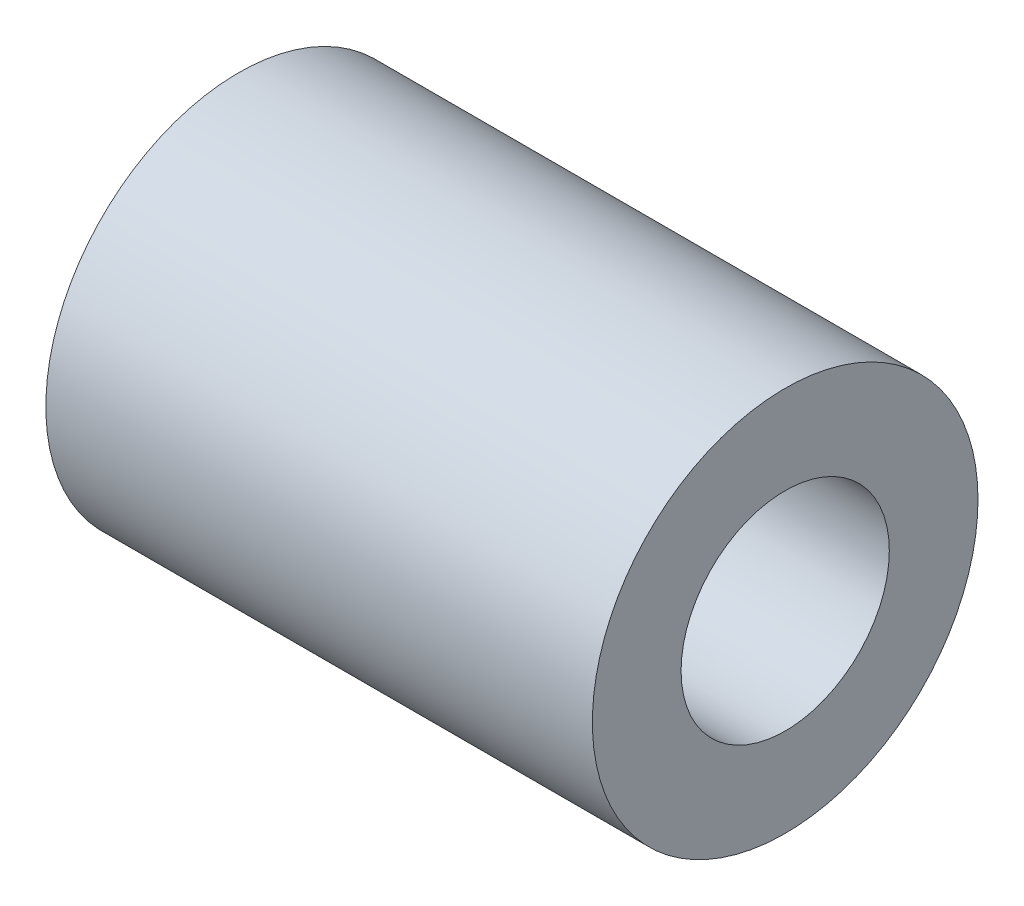
ISO-10303-21;
HEADER;
FILE_DESCRIPTION(('STEP AP214'),'2;1');
FILE_NAME('part.step','',(''),(''),'','','');
FILE_SCHEMA(('AUTOMOTIVE_DESIGN { 1 0 10303 214 1 1 1 1 }'));
ENDSEC;
DATA;
#1=APPLICATION_CONTEXT('core data for automotive mechanical design processes');
#2=APPLICATION_PROTOCOL_DEFINITION('international standard','automotive_design',2000,#1);
#3=PRODUCT_CONTEXT('',#1,'mechanical');
#4=PRODUCT('Part','Part','',(#3));
#5=PRODUCT_RELATED_PRODUCT_CATEGORY('part','',(#4));
#6=PRODUCT_DEFINITION_FORMATION('','',#4);
#7=PRODUCT_DEFINITION_CONTEXT('part definition',#1,'design');
#8=PRODUCT_DEFINITION('design','',#6,#7);
#9=PRODUCT_DEFINITION_SHAPE('','',#8);
#10=(LENGTH_UNIT() NAMED_UNIT(*) SI_UNIT(.MILLI.,.METRE.));
#11=(NAMED_UNIT(*) PLANE_ANGLE_UNIT() SI_UNIT($,.RADIAN.));
#12=(NAMED_UNIT(*) SI_UNIT($,.STERADIAN.) SOLID_ANGLE_UNIT());
#13=UNCERTAINTY_MEASURE_WITH_UNIT(LENGTH_MEASURE(1.E-05),#10,'distance_accuracy_value','');
#14=(GEOMETRIC_REPRESENTATION_CONTEXT(3) GLOBAL_UNCERTAINTY_ASSIGNED_CONTEXT((#13)) GLOBAL_UNIT_ASSIGNED_CONTEXT((#10,
#11,#12)) REPRESENTATION_CONTEXT('',''));
#15=CARTESIAN_POINT('',(0.,0.,0.));
#16=DIRECTION('',(0.,0.,1.));
#17=DIRECTION('',(1.,0.,0.));
#18=AXIS2_PLACEMENT_3D('',#15,#16,#17);
#19=CARTESIAN_POINT('',(-18.,0.,0.));
#20=DIRECTION('',(1.,0.,0.));
#21=DIRECTION('',(0.,0.,-1.));
#22=AXIS2_PLACEMENT_3D('',#19,#20,#21);
#23=CYLINDRICAL_SURFACE('',#22,6.35);
#24=CARTESIAN_POINT('',(-18.,0.,0.));
#25=DIRECTION('',(1.,0.,0.));
#26=DIRECTION('',(0.,0.,-1.));
#27=AXIS2_PLACEMENT_3D('',#24,#25,#26);
#28=CIRCLE('',#27,6.35);
#29=CARTESIAN_POINT('',(-18.,0.,-6.35));
#30=VERTEX_POINT('',#29);
#31=EDGE_CURVE('E10',#30,#30,#28,.T.);
#32=ORIENTED_EDGE('',*,*,#31,.T.);
#33=EDGE_LOOP('',(#32));
#34=FACE_BOUND('',#33,.T.);
#35=CARTESIAN_POINT('',(0.,0.,0.));
#36=DIRECTION('',(1.,0.,0.));
#37=DIRECTION('',(0.,0.,-1.));
#38=AXIS2_PLACEMENT_3D('',#35,#36,#37);
#39=CIRCLE('',#38,6.35);
#40=CARTESIAN_POINT('',(0.,0.,-6.35));
#41=VERTEX_POINT('',#40);
#42=EDGE_CURVE('E34',#41,#41,#39,.T.);
#43=ORIENTED_EDGE('',*,*,#42,.F.);
#44=EDGE_LOOP('',(#43));
#45=FACE_BOUND('',#44,.T.);
#46=ADVANCED_FACE('F31',(#34,#45),#23,.T.);
#47=CARTESIAN_POINT('',(-18.,0.,0.));
#48=DIRECTION('',(1.,0.,0.));
#49=DIRECTION('',(0.,0.,-1.));
#50=AXIS2_PLACEMENT_3D('',#47,#48,#49);
#51=PLANE('',#50);
#52=CARTESIAN_POINT('',(-18.,0.,0.));
#53=DIRECTION('',(1.,0.,0.));
#54=DIRECTION('',(0.,0.,-1.));
#55=AXIS2_PLACEMENT_3D('',#52,#53,#54);
#56=CIRCLE('',#55,3.429);
#57=CARTESIAN_POINT('',(-18.,0.,-3.429));
#58=VERTEX_POINT('',#57);
#59=EDGE_CURVE('E41',#58,#58,#56,.T.);
#60=ORIENTED_EDGE('',*,*,#59,.T.);
#61=EDGE_LOOP('',(#60));
#62=FACE_BOUND('',#61,.T.);
#63=ORIENTED_EDGE('',*,*,#31,.F.);
#64=EDGE_LOOP('',(#63));
#65=FACE_BOUND('',#64,.T.);
#66=ADVANCED_FACE('F49',(#62,#65),#51,.F.);
#67=CARTESIAN_POINT('',(0.,0.,0.));
#68=DIRECTION('',(1.,0.,0.));
#69=DIRECTION('',(0.,0.,-1.));
#70=AXIS2_PLACEMENT_3D('',#67,#68,#69);
#71=PLANE('',#70);
#72=CARTESIAN_POINT('',(0.,0.,0.));
#73=DIRECTION('',(1.,0.,0.));
#74=DIRECTION('',(0.,0.,-1.));
#75=AXIS2_PLACEMENT_3D('',#72,#73,#74);
#76=CIRCLE('',#75,3.429);
#77=CARTESIAN_POINT('',(0.,0.,-3.429));
#78=VERTEX_POINT('',#77);
#79=EDGE_CURVE('E43',#78,#78,#76,.T.);
#80=ORIENTED_EDGE('',*,*,#79,.F.);
#81=EDGE_LOOP('',(#80));
#82=FACE_BOUND('',#81,.T.);
#83=ORIENTED_EDGE('',*,*,#42,.T.);
#84=EDGE_LOOP('',(#83));
#85=FACE_BOUND('',#84,.T.);
#86=ADVANCED_FACE('F55',(#82,#85),#71,.T.);
#87=CARTESIAN_POINT('',(-18.,0.,0.));
#88=DIRECTION('',(1.,0.,0.));
#89=DIRECTION('',(0.,0.,-1.));
#90=AXIS2_PLACEMENT_3D('',#87,#88,#89);
#91=CYLINDRICAL_SURFACE('',#90,3.429);
#92=ORIENTED_EDGE('',*,*,#59,.F.);
#93=EDGE_LOOP('',(#92));
#94=FACE_BOUND('',#93,.T.);
#95=ORIENTED_EDGE('',*,*,#79,.T.);
#96=EDGE_LOOP('',(#95));
#97=FACE_BOUND('',#96,.T.);
#98=ADVANCED_FACE('F52',(#94,#97),#91,.F.);
#99=CLOSED_SHELL('',(#46,#66,#86,#98));
#100=MANIFOLD_SOLID_BREP('B2',#99);
#101=ADVANCED_BREP_SHAPE_REPRESENTATION('',(#18,#100),#14);
#102=SHAPE_DEFINITION_REPRESENTATION(#9,#101);
ENDSEC;
END-ISO-10303-21;
